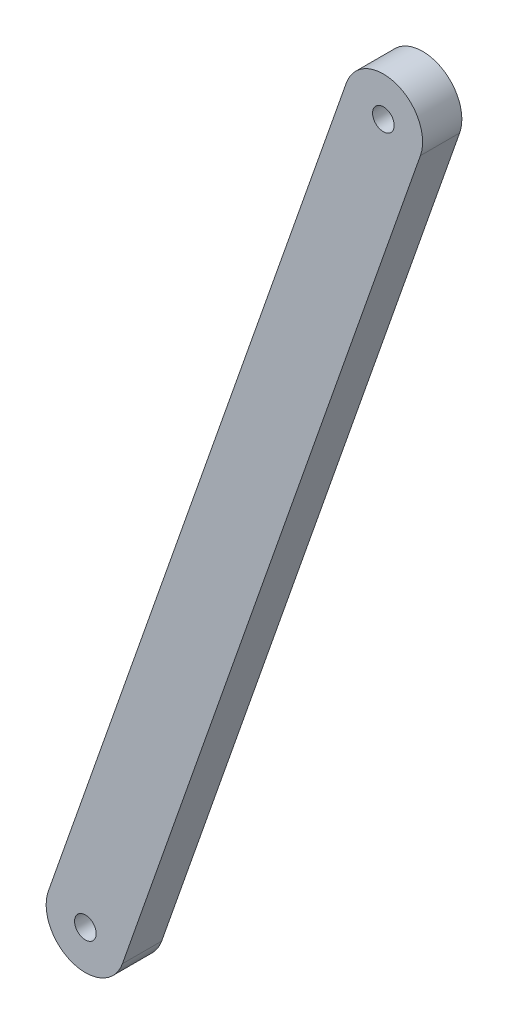
ISO-10303-21;
HEADER;
FILE_DESCRIPTION(('STEP AP214'),'2;1');
FILE_NAME('part.step','',(''),(''),'','','');
FILE_SCHEMA(('AUTOMOTIVE_DESIGN { 1 0 10303 214 1 1 1 1 }'));
ENDSEC;
DATA;
#1=APPLICATION_CONTEXT('core data for automotive mechanical design processes');
#2=APPLICATION_PROTOCOL_DEFINITION('international standard','automotive_design',2000,#1);
#3=PRODUCT_CONTEXT('',#1,'mechanical');
#4=PRODUCT('Part','Part','',(#3));
#5=PRODUCT_RELATED_PRODUCT_CATEGORY('part','',(#4));
#6=PRODUCT_DEFINITION_FORMATION('','',#4);
#7=PRODUCT_DEFINITION_CONTEXT('part definition',#1,'design');
#8=PRODUCT_DEFINITION('design','',#6,#7);
#9=PRODUCT_DEFINITION_SHAPE('','',#8);
#10=(LENGTH_UNIT() NAMED_UNIT(*) SI_UNIT(.MILLI.,.METRE.));
#11=(NAMED_UNIT(*) PLANE_ANGLE_UNIT() SI_UNIT($,.RADIAN.));
#12=(NAMED_UNIT(*) SI_UNIT($,.STERADIAN.) SOLID_ANGLE_UNIT());
#13=UNCERTAINTY_MEASURE_WITH_UNIT(LENGTH_MEASURE(1.E-05),#10,'distance_accuracy_value','');
#14=(GEOMETRIC_REPRESENTATION_CONTEXT(3) GLOBAL_UNCERTAINTY_ASSIGNED_CONTEXT((#13)) GLOBAL_UNIT_ASSIGNED_CONTEXT((#10,
#11,#12)) REPRESENTATION_CONTEXT('',''));
#15=CARTESIAN_POINT('',(0.,0.,0.));
#16=DIRECTION('',(0.,0.,1.));
#17=DIRECTION('',(1.,0.,0.));
#18=AXIS2_PLACEMENT_3D('',#15,#16,#17);
#19=CARTESIAN_POINT('',(77.1396310992052,255.485927840596,6.35));
#20=DIRECTION('',(0.,0.,1.));
#21=DIRECTION('',(1.,0.,0.));
#22=AXIS2_PLACEMENT_3D('',#19,#20,#21);
#23=PLANE('',#22);
#24=CARTESIAN_POINT('',(77.1396310992052,255.485927840596,6.35));
#25=DIRECTION('',(0.,0.,1.));
#26=DIRECTION('',(1.,0.,0.));
#27=AXIS2_PLACEMENT_3D('',#24,#25,#26);
#28=CIRCLE('',#27,1.75);
#29=CARTESIAN_POINT('',(78.8896310992052,255.485927840596,6.35));
#30=VERTEX_POINT('',#29);
#31=EDGE_CURVE('E99',#30,#30,#28,.T.);
#32=ORIENTED_EDGE('',*,*,#31,.F.);
#33=EDGE_LOOP('',(#32));
#34=FACE_BOUND('',#33,.T.);
#35=CARTESIAN_POINT('',(77.1396310992052,255.485927840596,6.35));
#36=DIRECTION('',(0.,0.,1.));
#37=DIRECTION('',(1.,0.,0.));
#38=AXIS2_PLACEMENT_3D('',#35,#36,#37);
#39=CIRCLE('',#38,6.35);
#40=CARTESIAN_POINT('',(71.148095027184,257.589257462331,6.35));
#41=VERTEX_POINT('',#40);
#42=CARTESIAN_POINT('',(83.1311671712264,253.382598218861,6.35));
#43=VERTEX_POINT('',#42);
#44=EDGE_CURVE('E84',#41,#43,#39,.T.);
#45=ORIENTED_EDGE('',*,*,#44,.T.);
#46=DIRECTION('',(0.331233011296878,0.943548987719876,0.));
#47=VECTOR('',#46,1.);
#48=CARTESIAN_POINT('',(83.1311671712264,253.382598218861,6.35));
#49=LINE('',#48,#47);
#50=CARTESIAN_POINT('',(131.362659908438,390.774629194982,6.35));
#51=VERTEX_POINT('',#50);
#52=EDGE_CURVE('E79',#43,#51,#49,.T.);
#53=ORIENTED_EDGE('',*,*,#52,.T.);
#54=CARTESIAN_POINT('',(125.371123836417,392.877958816718,6.35));
#55=DIRECTION('',(0.,0.,1.));
#56=DIRECTION('',(1.,0.,0.));
#57=AXIS2_PLACEMENT_3D('',#54,#55,#56);
#58=CIRCLE('',#57,6.34999999999998);
#59=CARTESIAN_POINT('',(119.379587764396,394.981288438453,6.35));
#60=VERTEX_POINT('',#59);
#61=EDGE_CURVE('E82',#51,#60,#58,.T.);
#62=ORIENTED_EDGE('',*,*,#61,.T.);
#63=DIRECTION('',(-0.331233011296879,-0.943548987719876,0.));
#64=VECTOR('',#63,1.);
#65=CARTESIAN_POINT('',(71.148095027184,257.589257462331,6.35));
#66=LINE('',#65,#64);
#67=EDGE_CURVE('E49',#60,#41,#66,.T.);
#68=ORIENTED_EDGE('',*,*,#67,.T.);
#69=EDGE_LOOP('',(#45,#53,#62,#68));
#70=FACE_BOUND('',#69,.T.);
#71=CARTESIAN_POINT('',(125.371123836417,392.877958816718,6.35));
#72=DIRECTION('',(0.,0.,1.));
#73=DIRECTION('',(1.,0.,0.));
#74=AXIS2_PLACEMENT_3D('',#71,#72,#73);
#75=CIRCLE('',#74,1.75000000000001);
#76=CARTESIAN_POINT('',(127.121123836417,392.877958816718,6.35));
#77=VERTEX_POINT('',#76);
#78=EDGE_CURVE('E114',#77,#77,#75,.T.);
#79=ORIENTED_EDGE('',*,*,#78,.F.);
#80=EDGE_LOOP('',(#79));
#81=FACE_BOUND('',#80,.T.);
#82=ADVANCED_FACE('F32',(#34,#70,#81),#23,.T.);
#83=CARTESIAN_POINT('',(77.1396310992052,255.485927840596,0.));
#84=DIRECTION('',(0.,0.,1.));
#85=DIRECTION('',(1.,0.,0.));
#86=AXIS2_PLACEMENT_3D('',#83,#84,#85);
#87=PLANE('',#86);
#88=CARTESIAN_POINT('',(77.1396310992052,255.485927840596,0.));
#89=DIRECTION('',(0.,0.,1.));
#90=DIRECTION('',(1.,0.,0.));
#91=AXIS2_PLACEMENT_3D('',#88,#89,#90);
#92=CIRCLE('',#91,1.75);
#93=CARTESIAN_POINT('',(78.8896310992052,255.485927840596,0.));
#94=VERTEX_POINT('',#93);
#95=EDGE_CURVE('E111',#94,#94,#92,.T.);
#96=ORIENTED_EDGE('',*,*,#95,.T.);
#97=EDGE_LOOP('',(#96));
#98=FACE_BOUND('',#97,.T.);
#99=CARTESIAN_POINT('',(77.1396310992052,255.485927840596,0.));
#100=DIRECTION('',(0.,0.,1.));
#101=DIRECTION('',(1.,0.,0.));
#102=AXIS2_PLACEMENT_3D('',#99,#100,#101);
#103=CIRCLE('',#102,6.35);
#104=CARTESIAN_POINT('',(71.148095027184,257.589257462331,0.));
#105=VERTEX_POINT('',#104);
#106=CARTESIAN_POINT('',(83.1311671712264,253.382598218861,0.));
#107=VERTEX_POINT('',#106);
#108=EDGE_CURVE('E96',#105,#107,#103,.T.);
#109=ORIENTED_EDGE('',*,*,#108,.F.);
#110=DIRECTION('',(-0.331233011296879,-0.943548987719876,0.));
#111=VECTOR('',#110,1.);
#112=CARTESIAN_POINT('',(71.148095027184,257.589257462331,0.));
#113=LINE('',#112,#111);
#114=CARTESIAN_POINT('',(119.379587764396,394.981288438453,0.));
#115=VERTEX_POINT('',#114);
#116=EDGE_CURVE('E72',#115,#105,#113,.T.);
#117=ORIENTED_EDGE('',*,*,#116,.F.);
#118=CARTESIAN_POINT('',(125.371123836417,392.877958816718,0.));
#119=DIRECTION('',(0.,0.,1.));
#120=DIRECTION('',(1.,0.,0.));
#121=AXIS2_PLACEMENT_3D('',#118,#119,#120);
#122=CIRCLE('',#121,6.34999999999998);
#123=CARTESIAN_POINT('',(131.362659908438,390.774629194982,0.));
#124=VERTEX_POINT('',#123);
#125=EDGE_CURVE('E66',#124,#115,#122,.T.);
#126=ORIENTED_EDGE('',*,*,#125,.F.);
#127=DIRECTION('',(0.331233011296878,0.943548987719876,0.));
#128=VECTOR('',#127,1.);
#129=CARTESIAN_POINT('',(83.1311671712264,253.382598218861,0.));
#130=LINE('',#129,#128);
#131=EDGE_CURVE('E88',#107,#124,#130,.T.);
#132=ORIENTED_EDGE('',*,*,#131,.F.);
#133=EDGE_LOOP('',(#109,#117,#126,#132));
#134=FACE_BOUND('',#133,.T.);
#135=CARTESIAN_POINT('',(125.371123836417,392.877958816718,0.));
#136=DIRECTION('',(0.,0.,1.));
#137=DIRECTION('',(1.,0.,0.));
#138=AXIS2_PLACEMENT_3D('',#135,#136,#137);
#139=CIRCLE('',#138,1.75000000000001);
#140=CARTESIAN_POINT('',(127.121123836417,392.877958816718,0.));
#141=VERTEX_POINT('',#140);
#142=EDGE_CURVE('E117',#141,#141,#139,.T.);
#143=ORIENTED_EDGE('',*,*,#142,.T.);
#144=EDGE_LOOP('',(#143));
#145=FACE_BOUND('',#144,.T.);
#146=ADVANCED_FACE('F107',(#98,#134,#145),#87,.F.);
#147=CARTESIAN_POINT('',(77.1396310992052,255.485927840596,6.35));
#148=DIRECTION('',(0.,0.,-1.));
#149=DIRECTION('',(-1.,0.,0.));
#150=AXIS2_PLACEMENT_3D('',#147,#148,#149);
#151=CYLINDRICAL_SURFACE('',#150,6.35);
#152=ORIENTED_EDGE('',*,*,#108,.T.);
#153=DIRECTION('',(0.,0.,-1.));
#154=VECTOR('',#153,1.);
#155=CARTESIAN_POINT('',(83.1311671712264,253.382598218861,6.35));
#156=LINE('',#155,#154);
#157=EDGE_CURVE('E11',#43,#107,#156,.T.);
#158=ORIENTED_EDGE('',*,*,#157,.F.);
#159=ORIENTED_EDGE('',*,*,#44,.F.);
#160=DIRECTION('',(0.,0.,-1.));
#161=VECTOR('',#160,1.);
#162=CARTESIAN_POINT('',(71.148095027184,257.589257462331,6.35));
#163=LINE('',#162,#161);
#164=EDGE_CURVE('E92',#41,#105,#163,.T.);
#165=ORIENTED_EDGE('',*,*,#164,.T.);
#166=EDGE_LOOP('',(#152,#158,#159,#165));
#167=FACE_BOUND('',#166,.T.);
#168=ADVANCED_FACE('F34',(#167),#151,.T.);
#169=CARTESIAN_POINT('',(83.1311671712264,253.382598218861,6.35));
#170=DIRECTION('',(-0.943548987719876,0.331233011296878,0.));
#171=DIRECTION('',(-0.331233011296878,-0.943548987719876,0.));
#172=AXIS2_PLACEMENT_3D('',#169,#170,#171);
#173=PLANE('',#172);
#174=ORIENTED_EDGE('',*,*,#131,.T.);
#175=DIRECTION('',(0.,0.,-1.));
#176=VECTOR('',#175,1.);
#177=CARTESIAN_POINT('',(131.362659908438,390.774629194982,6.35));
#178=LINE('',#177,#176);
#179=EDGE_CURVE('E41',#51,#124,#178,.T.);
#180=ORIENTED_EDGE('',*,*,#179,.F.);
#181=ORIENTED_EDGE('',*,*,#52,.F.);
#182=ORIENTED_EDGE('',*,*,#157,.T.);
#183=EDGE_LOOP('',(#174,#180,#181,#182));
#184=FACE_BOUND('',#183,.T.);
#185=ADVANCED_FACE('F87',(#184),#173,.F.);
#186=CARTESIAN_POINT('',(125.371123836417,392.877958816718,6.35));
#187=DIRECTION('',(0.,0.,-1.));
#188=DIRECTION('',(-1.,0.,0.));
#189=AXIS2_PLACEMENT_3D('',#186,#187,#188);
#190=CYLINDRICAL_SURFACE('',#189,6.34999999999998);
#191=ORIENTED_EDGE('',*,*,#125,.T.);
#192=DIRECTION('',(0.,0.,-1.));
#193=VECTOR('',#192,1.);
#194=CARTESIAN_POINT('',(119.379587764396,394.981288438453,6.35));
#195=LINE('',#194,#193);
#196=EDGE_CURVE('E89',#60,#115,#195,.T.);
#197=ORIENTED_EDGE('',*,*,#196,.F.);
#198=ORIENTED_EDGE('',*,*,#61,.F.);
#199=ORIENTED_EDGE('',*,*,#179,.T.);
#200=EDGE_LOOP('',(#191,#197,#198,#199));
#201=FACE_BOUND('',#200,.T.);
#202=ADVANCED_FACE('F90',(#201),#190,.T.);
#203=CARTESIAN_POINT('',(71.148095027184,257.589257462331,6.35));
#204=DIRECTION('',(0.943548987719876,-0.331233011296879,0.));
#205=DIRECTION('',(0.331233011296879,0.943548987719876,0.));
#206=AXIS2_PLACEMENT_3D('',#203,#204,#205);
#207=PLANE('',#206);
#208=ORIENTED_EDGE('',*,*,#116,.T.);
#209=ORIENTED_EDGE('',*,*,#164,.F.);
#210=ORIENTED_EDGE('',*,*,#67,.F.);
#211=ORIENTED_EDGE('',*,*,#196,.T.);
#212=EDGE_LOOP('',(#208,#209,#210,#211));
#213=FACE_BOUND('',#212,.T.);
#214=ADVANCED_FACE('F104',(#213),#207,.F.);
#215=CARTESIAN_POINT('',(77.1396310992052,255.485927840596,6.35));
#216=DIRECTION('',(0.,0.,-1.));
#217=DIRECTION('',(-1.,0.,0.));
#218=AXIS2_PLACEMENT_3D('',#215,#216,#217);
#219=CYLINDRICAL_SURFACE('',#218,1.75);
#220=ORIENTED_EDGE('',*,*,#31,.T.);
#221=EDGE_LOOP('',(#220));
#222=FACE_BOUND('',#221,.T.);
#223=ORIENTED_EDGE('',*,*,#95,.F.);
#224=EDGE_LOOP('',(#223));
#225=FACE_BOUND('',#224,.T.);
#226=ADVANCED_FACE('F135',(#222,#225),#219,.F.);
#227=CARTESIAN_POINT('',(125.371123836417,392.877958816718,6.35));
#228=DIRECTION('',(0.,0.,-1.));
#229=DIRECTION('',(-1.,0.,0.));
#230=AXIS2_PLACEMENT_3D('',#227,#228,#229);
#231=CYLINDRICAL_SURFACE('',#230,1.75000000000001);
#232=ORIENTED_EDGE('',*,*,#78,.T.);
#233=EDGE_LOOP('',(#232));
#234=FACE_BOUND('',#233,.T.);
#235=ORIENTED_EDGE('',*,*,#142,.F.);
#236=EDGE_LOOP('',(#235));
#237=FACE_BOUND('',#236,.T.);
#238=ADVANCED_FACE('F123',(#234,#237),#231,.F.);
#239=CLOSED_SHELL('',(#82,#146,#168,#185,#202,#214,#226,#238));
#240=MANIFOLD_SOLID_BREP('B2',#239);
#241=ADVANCED_BREP_SHAPE_REPRESENTATION('',(#18,#240),#14);
#242=SHAPE_DEFINITION_REPRESENTATION(#9,#241);
ENDSEC;
END-ISO-10303-21;
